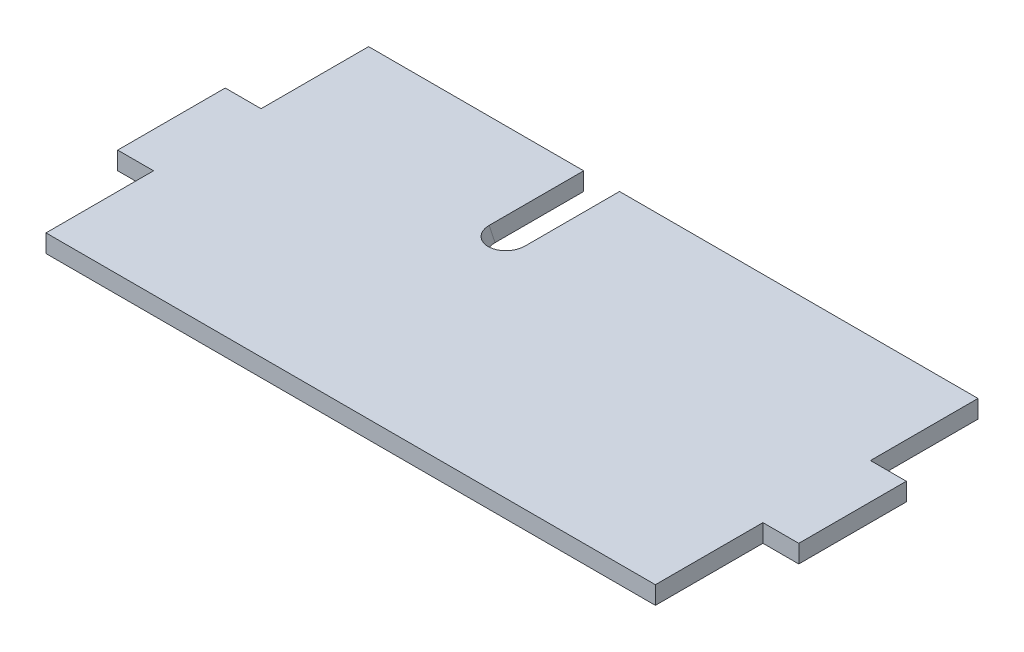
ISO-10303-21;
HEADER;
FILE_DESCRIPTION(('STEP AP214'),'2;1');
FILE_NAME('part.step','',(''),(''),'','','');
FILE_SCHEMA(('AUTOMOTIVE_DESIGN { 1 0 10303 214 1 1 1 1 }'));
ENDSEC;
DATA;
#1=APPLICATION_CONTEXT('core data for automotive mechanical design processes');
#2=APPLICATION_PROTOCOL_DEFINITION('international standard','automotive_design',2000,#1);
#3=PRODUCT_CONTEXT('',#1,'mechanical');
#4=PRODUCT('Part','Part','',(#3));
#5=PRODUCT_RELATED_PRODUCT_CATEGORY('part','',(#4));
#6=PRODUCT_DEFINITION_FORMATION('','',#4);
#7=PRODUCT_DEFINITION_CONTEXT('part definition',#1,'design');
#8=PRODUCT_DEFINITION('design','',#6,#7);
#9=PRODUCT_DEFINITION_SHAPE('','',#8);
#10=(LENGTH_UNIT() NAMED_UNIT(*) SI_UNIT(.MILLI.,.METRE.));
#11=(NAMED_UNIT(*) PLANE_ANGLE_UNIT() SI_UNIT($,.RADIAN.));
#12=(NAMED_UNIT(*) SI_UNIT($,.STERADIAN.) SOLID_ANGLE_UNIT());
#13=UNCERTAINTY_MEASURE_WITH_UNIT(LENGTH_MEASURE(1.E-05),#10,'distance_accuracy_value','');
#14=(GEOMETRIC_REPRESENTATION_CONTEXT(3) GLOBAL_UNCERTAINTY_ASSIGNED_CONTEXT((#13)) GLOBAL_UNIT_ASSIGNED_CONTEXT((#10,
#11,#12)) REPRESENTATION_CONTEXT('',''));
#15=CARTESIAN_POINT('',(0.,0.,0.));
#16=DIRECTION('',(0.,0.,1.));
#17=DIRECTION('',(1.,0.,0.));
#18=AXIS2_PLACEMENT_3D('',#15,#16,#17);
#19=CARTESIAN_POINT('',(-215.9,6.35,-88.9));
#20=DIRECTION('',(0.,0.,1.));
#21=DIRECTION('',(1.,0.,0.));
#22=AXIS2_PLACEMENT_3D('',#19,#20,#21);
#23=PLANE('',#22);
#24=DIRECTION('',(-1.,0.,0.));
#25=VECTOR('',#24,1.);
#26=CARTESIAN_POINT('',(-215.9,6.35,-88.9));
#27=LINE('',#26,#25);
#28=CARTESIAN_POINT('',(-63.5000000000009,6.34999999999999,-88.9));
#29=VERTEX_POINT('',#28);
#30=CARTESIAN_POINT('',(-215.9,6.35,-88.9));
#31=VERTEX_POINT('',#30);
#32=EDGE_CURVE('E279',#29,#31,#27,.T.);
#33=ORIENTED_EDGE('',*,*,#32,.F.);
#34=DIRECTION('',(0.,1.,0.));
#35=VECTOR('',#34,1.);
#36=CARTESIAN_POINT('',(-63.5000000000009,6.34999999999999,-88.9));
#37=LINE('',#36,#35);
#38=CARTESIAN_POINT('',(-63.5000000000009,-6.34999999999999,-88.9));
#39=VERTEX_POINT('',#38);
#40=EDGE_CURVE('E166',#39,#29,#37,.T.);
#41=ORIENTED_EDGE('',*,*,#40,.F.);
#42=DIRECTION('',(-1.,0.,0.));
#43=VECTOR('',#42,1.);
#44=CARTESIAN_POINT('',(-215.9,-6.35,-88.9));
#45=LINE('',#44,#43);
#46=CARTESIAN_POINT('',(-215.9,-6.35,-88.9));
#47=VERTEX_POINT('',#46);
#48=EDGE_CURVE('E173',#39,#47,#45,.T.);
#49=ORIENTED_EDGE('',*,*,#48,.T.);
#50=DIRECTION('',(0.,-1.,0.));
#51=VECTOR('',#50,1.);
#52=CARTESIAN_POINT('',(-215.9,6.35,-88.9));
#53=LINE('',#52,#51);
#54=EDGE_CURVE('E246',#31,#47,#53,.T.);
#55=ORIENTED_EDGE('',*,*,#54,.F.);
#56=EDGE_LOOP('',(#33,#41,#49,#55));
#57=FACE_BOUND('',#56,.T.);
#58=ADVANCED_FACE('F43',(#57),#23,.F.);
#59=CARTESIAN_POINT('',(-50.7999999999984,-226.171808135511,-98.2610939856412));
#60=DIRECTION('',(0.,0.950122861158082,0.31187585463575));
#61=DIRECTION('',(0.,0.31187585463575,-0.950122861158083));
#62=AXIS2_PLACEMENT_3D('',#59,#60,#61);
#63=CYLINDRICAL_SURFACE('',#62,12.7000000000001);
#64=CARTESIAN_POINT('',(-50.7999999999983,-6.34999999999999,-26.1050422974673));
#65=DIRECTION('',(0.,1.,0.));
#66=DIRECTION('',(0.,0.,1.));
#67=AXIS2_PLACEMENT_3D('',#64,#65,#66);
#68=ELLIPSE('',#67,13.3666923712586,12.7000000000001);
#69=CARTESIAN_POINT('',(-38.0999999999989,-6.34999999999999,-26.1050422974674));
#70=VERTEX_POINT('',#69);
#71=CARTESIAN_POINT('',(-63.4999999999984,-6.34999999999999,-26.1050422974673));
#72=VERTEX_POINT('',#71);
#73=EDGE_CURVE('E11',#70,#72,#68,.F.);
#74=ORIENTED_EDGE('',*,*,#73,.T.);
#75=DIRECTION('',(0.,0.950122861158082,0.31187585463575));
#76=VECTOR('',#75,1.);
#77=CARTESIAN_POINT('',(-63.4999999999997,-226.171808135511,-98.2610939856412));
#78=LINE('',#77,#76);
#79=CARTESIAN_POINT('',(-63.4999999999996,6.34999999999999,-21.936293690528));
#80=VERTEX_POINT('',#79);
#81=EDGE_CURVE('E156',#80,#72,#78,.F.);
#82=ORIENTED_EDGE('',*,*,#81,.F.);
#83=CARTESIAN_POINT('',(-50.7999999999983,6.34999999999999,-21.936293690528));
#84=DIRECTION('',(0.,1.,0.));
#85=DIRECTION('',(0.,0.,1.));
#86=AXIS2_PLACEMENT_3D('',#83,#84,#85);
#87=ELLIPSE('',#86,13.3666923712586,12.7000000000001);
#88=CARTESIAN_POINT('',(-38.0999999999982,6.34999999999999,-21.936293690528));
#89=VERTEX_POINT('',#88);
#90=EDGE_CURVE('E47',#89,#80,#87,.F.);
#91=ORIENTED_EDGE('',*,*,#90,.F.);
#92=DIRECTION('',(0.,0.950122861158082,0.31187585463575));
#93=VECTOR('',#92,1.);
#94=CARTESIAN_POINT('',(-38.0999999999989,-226.171808135511,-98.2610939856412));
#95=LINE('',#94,#93);
#96=EDGE_CURVE('E175',#89,#70,#95,.F.);
#97=ORIENTED_EDGE('',*,*,#96,.T.);
#98=EDGE_LOOP('',(#74,#82,#91,#97));
#99=FACE_BOUND('',#98,.T.);
#100=ADVANCED_FACE('F177',(#99),#63,.F.);
#101=CARTESIAN_POINT('',(-215.9,6.35,-88.9));
#102=DIRECTION('',(1.,0.,0.));
#103=DIRECTION('',(0.,0.,-1.));
#104=AXIS2_PLACEMENT_3D('',#101,#102,#103);
#105=PLANE('',#104);
#106=DIRECTION('',(0.,0.,1.));
#107=VECTOR('',#106,1.);
#108=CARTESIAN_POINT('',(-215.9,-6.35,-88.9));
#109=LINE('',#108,#107);
#110=CARTESIAN_POINT('',(-215.9,-6.35,-12.7));
#111=VERTEX_POINT('',#110);
#112=EDGE_CURVE('E165',#47,#111,#109,.T.);
#113=ORIENTED_EDGE('',*,*,#112,.T.);
#114=DIRECTION('',(0.,-1.,0.));
#115=VECTOR('',#114,1.);
#116=CARTESIAN_POINT('',(-215.9,6.35,-12.7));
#117=LINE('',#116,#115);
#118=CARTESIAN_POINT('',(-215.9,6.35,-12.7));
#119=VERTEX_POINT('',#118);
#120=EDGE_CURVE('E191',#119,#111,#117,.T.);
#121=ORIENTED_EDGE('',*,*,#120,.F.);
#122=DIRECTION('',(0.,0.,1.));
#123=VECTOR('',#122,1.);
#124=CARTESIAN_POINT('',(-215.9,6.35,-88.9));
#125=LINE('',#124,#123);
#126=EDGE_CURVE('E309',#31,#119,#125,.T.);
#127=ORIENTED_EDGE('',*,*,#126,.F.);
#128=ORIENTED_EDGE('',*,*,#54,.T.);
#129=EDGE_LOOP('',(#113,#121,#127,#128));
#130=FACE_BOUND('',#129,.T.);
#131=ADVANCED_FACE('F330',(#130),#105,.F.);
#132=CARTESIAN_POINT('',(-241.3,6.35,-12.7));
#133=DIRECTION('',(0.,0.,1.));
#134=DIRECTION('',(1.,0.,0.));
#135=AXIS2_PLACEMENT_3D('',#132,#133,#134);
#136=PLANE('',#135);
#137=DIRECTION('',(-1.,0.,0.));
#138=VECTOR('',#137,1.);
#139=CARTESIAN_POINT('',(-241.3,-6.35,-12.7));
#140=LINE('',#139,#138);
#141=CARTESIAN_POINT('',(-241.3,-6.35,-12.7));
#142=VERTEX_POINT('',#141);
#143=EDGE_CURVE('E196',#111,#142,#140,.T.);
#144=ORIENTED_EDGE('',*,*,#143,.T.);
#145=DIRECTION('',(0.,-1.,0.));
#146=VECTOR('',#145,1.);
#147=CARTESIAN_POINT('',(-241.3,6.35,-12.7));
#148=LINE('',#147,#146);
#149=CARTESIAN_POINT('',(-241.3,6.35,-12.7));
#150=VERTEX_POINT('',#149);
#151=EDGE_CURVE('E197',#150,#142,#148,.T.);
#152=ORIENTED_EDGE('',*,*,#151,.F.);
#153=DIRECTION('',(-1.,0.,0.));
#154=VECTOR('',#153,1.);
#155=CARTESIAN_POINT('',(-241.3,6.35,-12.7));
#156=LINE('',#155,#154);
#157=EDGE_CURVE('E307',#119,#150,#156,.T.);
#158=ORIENTED_EDGE('',*,*,#157,.F.);
#159=ORIENTED_EDGE('',*,*,#120,.T.);
#160=EDGE_LOOP('',(#144,#152,#158,#159));
#161=FACE_BOUND('',#160,.T.);
#162=ADVANCED_FACE('F332',(#161),#136,.F.);
#163=CARTESIAN_POINT('',(-241.3,6.35,-12.7));
#164=DIRECTION('',(1.,0.,0.));
#165=DIRECTION('',(0.,0.,-1.));
#166=AXIS2_PLACEMENT_3D('',#163,#164,#165);
#167=PLANE('',#166);
#168=DIRECTION('',(0.,0.,1.));
#169=VECTOR('',#168,1.);
#170=CARTESIAN_POINT('',(-241.3,-6.35,-12.7));
#171=LINE('',#170,#169);
#172=CARTESIAN_POINT('',(-241.3,-6.35,63.5));
#173=VERTEX_POINT('',#172);
#174=EDGE_CURVE('E195',#142,#173,#171,.T.);
#175=ORIENTED_EDGE('',*,*,#174,.T.);
#176=DIRECTION('',(0.,-1.,0.));
#177=VECTOR('',#176,1.);
#178=CARTESIAN_POINT('',(-241.3,6.35,63.5));
#179=LINE('',#178,#177);
#180=CARTESIAN_POINT('',(-241.3,6.35,63.5));
#181=VERTEX_POINT('',#180);
#182=EDGE_CURVE('E202',#181,#173,#179,.T.);
#183=ORIENTED_EDGE('',*,*,#182,.F.);
#184=DIRECTION('',(0.,0.,1.));
#185=VECTOR('',#184,1.);
#186=CARTESIAN_POINT('',(-241.3,6.35,-12.7));
#187=LINE('',#186,#185);
#188=EDGE_CURVE('E304',#150,#181,#187,.T.);
#189=ORIENTED_EDGE('',*,*,#188,.F.);
#190=ORIENTED_EDGE('',*,*,#151,.T.);
#191=EDGE_LOOP('',(#175,#183,#189,#190));
#192=FACE_BOUND('',#191,.T.);
#193=ADVANCED_FACE('F339',(#192),#167,.F.);
#194=CARTESIAN_POINT('',(-215.9,6.35,63.5));
#195=DIRECTION('',(0.,0.,-1.));
#196=DIRECTION('',(-1.,0.,0.));
#197=AXIS2_PLACEMENT_3D('',#194,#195,#196);
#198=PLANE('',#197);
#199=DIRECTION('',(1.,0.,0.));
#200=VECTOR('',#199,1.);
#201=CARTESIAN_POINT('',(-215.9,-6.35,63.5));
#202=LINE('',#201,#200);
#203=CARTESIAN_POINT('',(-215.9,-6.35,63.5));
#204=VERTEX_POINT('',#203);
#205=EDGE_CURVE('E201',#173,#204,#202,.T.);
#206=ORIENTED_EDGE('',*,*,#205,.T.);
#207=DIRECTION('',(0.,-1.,0.));
#208=VECTOR('',#207,1.);
#209=CARTESIAN_POINT('',(-215.9,6.35,63.5));
#210=LINE('',#209,#208);
#211=CARTESIAN_POINT('',(-215.9,6.35,63.5));
#212=VERTEX_POINT('',#211);
#213=EDGE_CURVE('E207',#212,#204,#210,.T.);
#214=ORIENTED_EDGE('',*,*,#213,.F.);
#215=DIRECTION('',(1.,0.,0.));
#216=VECTOR('',#215,1.);
#217=CARTESIAN_POINT('',(-215.9,6.35,63.5));
#218=LINE('',#217,#216);
#219=EDGE_CURVE('E301',#181,#212,#218,.T.);
#220=ORIENTED_EDGE('',*,*,#219,.F.);
#221=ORIENTED_EDGE('',*,*,#182,.T.);
#222=EDGE_LOOP('',(#206,#214,#220,#221));
#223=FACE_BOUND('',#222,.T.);
#224=ADVANCED_FACE('F343',(#223),#198,.F.);
#225=CARTESIAN_POINT('',(-215.9,6.35,63.5));
#226=DIRECTION('',(1.,0.,0.));
#227=DIRECTION('',(0.,0.,-1.));
#228=AXIS2_PLACEMENT_3D('',#225,#226,#227);
#229=PLANE('',#228);
#230=DIRECTION('',(0.,0.,1.));
#231=VECTOR('',#230,1.);
#232=CARTESIAN_POINT('',(-215.9,-6.35,63.5));
#233=LINE('',#232,#231);
#234=CARTESIAN_POINT('',(-215.9,-6.35,139.7));
#235=VERTEX_POINT('',#234);
#236=EDGE_CURVE('E206',#204,#235,#233,.T.);
#237=ORIENTED_EDGE('',*,*,#236,.T.);
#238=DIRECTION('',(0.,-1.,0.));
#239=VECTOR('',#238,1.);
#240=CARTESIAN_POINT('',(-215.9,6.35,139.7));
#241=LINE('',#240,#239);
#242=CARTESIAN_POINT('',(-215.9,6.35,139.7));
#243=VERTEX_POINT('',#242);
#244=EDGE_CURVE('E212',#243,#235,#241,.T.);
#245=ORIENTED_EDGE('',*,*,#244,.F.);
#246=DIRECTION('',(0.,0.,1.));
#247=VECTOR('',#246,1.);
#248=CARTESIAN_POINT('',(-215.9,6.35,63.5));
#249=LINE('',#248,#247);
#250=EDGE_CURVE('E298',#212,#243,#249,.T.);
#251=ORIENTED_EDGE('',*,*,#250,.F.);
#252=ORIENTED_EDGE('',*,*,#213,.T.);
#253=EDGE_LOOP('',(#237,#245,#251,#252));
#254=FACE_BOUND('',#253,.T.);
#255=ADVANCED_FACE('F348',(#254),#229,.F.);
#256=CARTESIAN_POINT('',(-215.9,6.35,139.7));
#257=DIRECTION('',(0.,0.,-1.));
#258=DIRECTION('',(-1.,0.,0.));
#259=AXIS2_PLACEMENT_3D('',#256,#257,#258);
#260=PLANE('',#259);
#261=DIRECTION('',(1.,0.,0.));
#262=VECTOR('',#261,1.);
#263=CARTESIAN_POINT('',(-215.9,-6.35,139.7));
#264=LINE('',#263,#262);
#265=CARTESIAN_POINT('',(215.9,-6.35,139.7));
#266=VERTEX_POINT('',#265);
#267=EDGE_CURVE('E211',#235,#266,#264,.T.);
#268=ORIENTED_EDGE('',*,*,#267,.T.);
#269=DIRECTION('',(0.,-1.,0.));
#270=VECTOR('',#269,1.);
#271=CARTESIAN_POINT('',(215.9,6.35,139.7));
#272=LINE('',#271,#270);
#273=CARTESIAN_POINT('',(215.9,6.35,139.7));
#274=VERTEX_POINT('',#273);
#275=EDGE_CURVE('E217',#274,#266,#272,.T.);
#276=ORIENTED_EDGE('',*,*,#275,.F.);
#277=DIRECTION('',(1.,0.,0.));
#278=VECTOR('',#277,1.);
#279=CARTESIAN_POINT('',(-215.9,6.35,139.7));
#280=LINE('',#279,#278);
#281=EDGE_CURVE('E295',#243,#274,#280,.T.);
#282=ORIENTED_EDGE('',*,*,#281,.F.);
#283=ORIENTED_EDGE('',*,*,#244,.T.);
#284=EDGE_LOOP('',(#268,#276,#282,#283));
#285=FACE_BOUND('',#284,.T.);
#286=ADVANCED_FACE('F354',(#285),#260,.F.);
#287=CARTESIAN_POINT('',(215.9,6.35,63.5));
#288=DIRECTION('',(-1.,0.,0.));
#289=DIRECTION('',(0.,0.,1.));
#290=AXIS2_PLACEMENT_3D('',#287,#288,#289);
#291=PLANE('',#290);
#292=DIRECTION('',(0.,0.,-1.));
#293=VECTOR('',#292,1.);
#294=CARTESIAN_POINT('',(215.9,-6.35,63.5));
#295=LINE('',#294,#293);
#296=CARTESIAN_POINT('',(215.9,-6.35,63.5));
#297=VERTEX_POINT('',#296);
#298=EDGE_CURVE('E216',#266,#297,#295,.T.);
#299=ORIENTED_EDGE('',*,*,#298,.T.);
#300=DIRECTION('',(0.,-1.,0.));
#301=VECTOR('',#300,1.);
#302=CARTESIAN_POINT('',(215.9,6.35,63.5));
#303=LINE('',#302,#301);
#304=CARTESIAN_POINT('',(215.9,6.35,63.5));
#305=VERTEX_POINT('',#304);
#306=EDGE_CURVE('E222',#305,#297,#303,.T.);
#307=ORIENTED_EDGE('',*,*,#306,.F.);
#308=DIRECTION('',(0.,0.,-1.));
#309=VECTOR('',#308,1.);
#310=CARTESIAN_POINT('',(215.9,6.35,63.5));
#311=LINE('',#310,#309);
#312=EDGE_CURVE('E292',#274,#305,#311,.T.);
#313=ORIENTED_EDGE('',*,*,#312,.F.);
#314=ORIENTED_EDGE('',*,*,#275,.T.);
#315=EDGE_LOOP('',(#299,#307,#313,#314));
#316=FACE_BOUND('',#315,.T.);
#317=ADVANCED_FACE('F358',(#316),#291,.F.);
#318=CARTESIAN_POINT('',(215.9,6.35,63.5));
#319=DIRECTION('',(0.,0.,-1.));
#320=DIRECTION('',(-1.,0.,0.));
#321=AXIS2_PLACEMENT_3D('',#318,#319,#320);
#322=PLANE('',#321);
#323=DIRECTION('',(1.,0.,0.));
#324=VECTOR('',#323,1.);
#325=CARTESIAN_POINT('',(215.9,-6.35,63.5));
#326=LINE('',#325,#324);
#327=CARTESIAN_POINT('',(241.3,-6.35,63.5));
#328=VERTEX_POINT('',#327);
#329=EDGE_CURVE('E221',#297,#328,#326,.T.);
#330=ORIENTED_EDGE('',*,*,#329,.T.);
#331=DIRECTION('',(0.,-1.,0.));
#332=VECTOR('',#331,1.);
#333=CARTESIAN_POINT('',(241.3,6.35,63.5));
#334=LINE('',#333,#332);
#335=CARTESIAN_POINT('',(241.3,6.35,63.5));
#336=VERTEX_POINT('',#335);
#337=EDGE_CURVE('E227',#336,#328,#334,.T.);
#338=ORIENTED_EDGE('',*,*,#337,.F.);
#339=DIRECTION('',(1.,0.,0.));
#340=VECTOR('',#339,1.);
#341=CARTESIAN_POINT('',(215.9,6.35,63.5));
#342=LINE('',#341,#340);
#343=EDGE_CURVE('E289',#305,#336,#342,.T.);
#344=ORIENTED_EDGE('',*,*,#343,.F.);
#345=ORIENTED_EDGE('',*,*,#306,.T.);
#346=EDGE_LOOP('',(#330,#338,#344,#345));
#347=FACE_BOUND('',#346,.T.);
#348=ADVANCED_FACE('F363',(#347),#322,.F.);
#349=CARTESIAN_POINT('',(241.3,6.35,-12.7));
#350=DIRECTION('',(-1.,0.,0.));
#351=DIRECTION('',(0.,0.,1.));
#352=AXIS2_PLACEMENT_3D('',#349,#350,#351);
#353=PLANE('',#352);
#354=DIRECTION('',(0.,0.,-1.));
#355=VECTOR('',#354,1.);
#356=CARTESIAN_POINT('',(241.3,-6.35,-12.7));
#357=LINE('',#356,#355);
#358=CARTESIAN_POINT('',(241.3,-6.35,-12.7));
#359=VERTEX_POINT('',#358);
#360=EDGE_CURVE('E226',#328,#359,#357,.T.);
#361=ORIENTED_EDGE('',*,*,#360,.T.);
#362=DIRECTION('',(0.,-1.,0.));
#363=VECTOR('',#362,1.);
#364=CARTESIAN_POINT('',(241.3,6.35,-12.7));
#365=LINE('',#364,#363);
#366=CARTESIAN_POINT('',(241.3,6.35,-12.7));
#367=VERTEX_POINT('',#366);
#368=EDGE_CURVE('E232',#367,#359,#365,.T.);
#369=ORIENTED_EDGE('',*,*,#368,.F.);
#370=DIRECTION('',(0.,0.,-1.));
#371=VECTOR('',#370,1.);
#372=CARTESIAN_POINT('',(241.3,6.35,-12.7));
#373=LINE('',#372,#371);
#374=EDGE_CURVE('E286',#336,#367,#373,.T.);
#375=ORIENTED_EDGE('',*,*,#374,.F.);
#376=ORIENTED_EDGE('',*,*,#337,.T.);
#377=EDGE_LOOP('',(#361,#369,#375,#376));
#378=FACE_BOUND('',#377,.T.);
#379=ADVANCED_FACE('F369',(#378),#353,.F.);
#380=CARTESIAN_POINT('',(241.3,6.35,-12.7));
#381=DIRECTION('',(0.,0.,1.));
#382=DIRECTION('',(1.,0.,0.));
#383=AXIS2_PLACEMENT_3D('',#380,#381,#382);
#384=PLANE('',#383);
#385=DIRECTION('',(-1.,0.,0.));
#386=VECTOR('',#385,1.);
#387=CARTESIAN_POINT('',(241.3,-6.35,-12.7));
#388=LINE('',#387,#386);
#389=CARTESIAN_POINT('',(215.9,-6.35,-12.7));
#390=VERTEX_POINT('',#389);
#391=EDGE_CURVE('E231',#359,#390,#388,.T.);
#392=ORIENTED_EDGE('',*,*,#391,.T.);
#393=DIRECTION('',(0.,-1.,0.));
#394=VECTOR('',#393,1.);
#395=CARTESIAN_POINT('',(215.9,6.35,-12.7));
#396=LINE('',#395,#394);
#397=CARTESIAN_POINT('',(215.9,6.35,-12.7));
#398=VERTEX_POINT('',#397);
#399=EDGE_CURVE('E237',#398,#390,#396,.T.);
#400=ORIENTED_EDGE('',*,*,#399,.F.);
#401=DIRECTION('',(-1.,0.,0.));
#402=VECTOR('',#401,1.);
#403=CARTESIAN_POINT('',(241.3,6.35,-12.7));
#404=LINE('',#403,#402);
#405=EDGE_CURVE('E283',#367,#398,#404,.T.);
#406=ORIENTED_EDGE('',*,*,#405,.F.);
#407=ORIENTED_EDGE('',*,*,#368,.T.);
#408=EDGE_LOOP('',(#392,#400,#406,#407));
#409=FACE_BOUND('',#408,.T.);
#410=ADVANCED_FACE('F373',(#409),#384,.F.);
#411=CARTESIAN_POINT('',(215.9,6.35,-88.9));
#412=DIRECTION('',(-1.,0.,0.));
#413=DIRECTION('',(0.,0.,1.));
#414=AXIS2_PLACEMENT_3D('',#411,#412,#413);
#415=PLANE('',#414);
#416=DIRECTION('',(0.,0.,-1.));
#417=VECTOR('',#416,1.);
#418=CARTESIAN_POINT('',(215.9,-6.35,-88.9));
#419=LINE('',#418,#417);
#420=CARTESIAN_POINT('',(215.9,-6.35,-88.9));
#421=VERTEX_POINT('',#420);
#422=EDGE_CURVE('E236',#390,#421,#419,.T.);
#423=ORIENTED_EDGE('',*,*,#422,.T.);
#424=DIRECTION('',(0.,-1.,0.));
#425=VECTOR('',#424,1.);
#426=CARTESIAN_POINT('',(215.9,6.35,-88.9));
#427=LINE('',#426,#425);
#428=CARTESIAN_POINT('',(215.9,6.35,-88.9));
#429=VERTEX_POINT('',#428);
#430=EDGE_CURVE('E241',#429,#421,#427,.T.);
#431=ORIENTED_EDGE('',*,*,#430,.F.);
#432=DIRECTION('',(0.,0.,-1.));
#433=VECTOR('',#432,1.);
#434=CARTESIAN_POINT('',(215.9,6.35,-88.9));
#435=LINE('',#434,#433);
#436=EDGE_CURVE('E280',#398,#429,#435,.T.);
#437=ORIENTED_EDGE('',*,*,#436,.F.);
#438=ORIENTED_EDGE('',*,*,#399,.T.);
#439=EDGE_LOOP('',(#423,#431,#437,#438));
#440=FACE_BOUND('',#439,.T.);
#441=ADVANCED_FACE('F378',(#440),#415,.F.);
#442=CARTESIAN_POINT('',(-38.1000000000006,-6.35,-88.9));
#443=VERTEX_POINT('',#442);
#444=EDGE_CURVE('E245',#421,#443,#45,.T.);
#445=ORIENTED_EDGE('',*,*,#444,.T.);
#446=DIRECTION('',(0.,-1.,0.));
#447=VECTOR('',#446,1.);
#448=CARTESIAN_POINT('',(-38.1000000000006,-6.35,-88.9));
#449=LINE('',#448,#447);
#450=CARTESIAN_POINT('',(-38.1000000000007,6.34999999999999,-88.9));
#451=VERTEX_POINT('',#450);
#452=EDGE_CURVE('E182',#451,#443,#449,.T.);
#453=ORIENTED_EDGE('',*,*,#452,.F.);
#454=EDGE_CURVE('E53',#429,#451,#27,.T.);
#455=ORIENTED_EDGE('',*,*,#454,.F.);
#456=ORIENTED_EDGE('',*,*,#430,.T.);
#457=EDGE_LOOP('',(#445,#453,#455,#456));
#458=FACE_BOUND('',#457,.T.);
#459=ADVANCED_FACE('F321',(#458),#23,.F.);
#460=CARTESIAN_POINT('',(0.,6.35,0.));
#461=DIRECTION('',(0.,1.,0.));
#462=DIRECTION('',(0.,0.,1.));
#463=AXIS2_PLACEMENT_3D('',#460,#461,#462);
#464=PLANE('',#463);
#465=DIRECTION('',(0.,0.,-1.));
#466=VECTOR('',#465,1.);
#467=CARTESIAN_POINT('',(-63.5000000000009,6.34999999999999,139.701));
#468=LINE('',#467,#466);
#469=EDGE_CURVE('E69',#80,#29,#468,.T.);
#470=ORIENTED_EDGE('',*,*,#469,.T.);
#471=ORIENTED_EDGE('',*,*,#32,.T.);
#472=ORIENTED_EDGE('',*,*,#126,.T.);
#473=ORIENTED_EDGE('',*,*,#157,.T.);
#474=ORIENTED_EDGE('',*,*,#188,.T.);
#475=ORIENTED_EDGE('',*,*,#219,.T.);
#476=ORIENTED_EDGE('',*,*,#250,.T.);
#477=ORIENTED_EDGE('',*,*,#281,.T.);
#478=ORIENTED_EDGE('',*,*,#312,.T.);
#479=ORIENTED_EDGE('',*,*,#343,.T.);
#480=ORIENTED_EDGE('',*,*,#374,.T.);
#481=ORIENTED_EDGE('',*,*,#405,.T.);
#482=ORIENTED_EDGE('',*,*,#436,.T.);
#483=ORIENTED_EDGE('',*,*,#454,.T.);
#484=DIRECTION('',(0.,0.,-1.));
#485=VECTOR('',#484,1.);
#486=CARTESIAN_POINT('',(-38.1000000000007,6.34999999999999,139.701));
#487=LINE('',#486,#485);
#488=EDGE_CURVE('E186',#89,#451,#487,.T.);
#489=ORIENTED_EDGE('',*,*,#488,.F.);
#490=ORIENTED_EDGE('',*,*,#90,.T.);
#491=EDGE_LOOP('',(#470,#471,#472,#473,#474,#475,#476,#477,#478,#479,#480,#481,#482,#483,#489,#490));
#492=FACE_BOUND('',#491,.T.);
#493=ADVANCED_FACE('F45',(#492),#464,.T.);
#494=CARTESIAN_POINT('',(0.,-6.35,0.));
#495=DIRECTION('',(0.,1.,0.));
#496=DIRECTION('',(0.,0.,1.));
#497=AXIS2_PLACEMENT_3D('',#494,#495,#496);
#498=PLANE('',#497);
#499=ORIENTED_EDGE('',*,*,#48,.F.);
#500=DIRECTION('',(0.,0.,-1.));
#501=VECTOR('',#500,1.);
#502=CARTESIAN_POINT('',(-63.5000000000009,-6.34999999999999,139.701));
#503=LINE('',#502,#501);
#504=EDGE_CURVE('E159',#72,#39,#503,.T.);
#505=ORIENTED_EDGE('',*,*,#504,.F.);
#506=ORIENTED_EDGE('',*,*,#73,.F.);
#507=DIRECTION('',(0.,0.,-1.));
#508=VECTOR('',#507,1.);
#509=CARTESIAN_POINT('',(-38.1000000000006,-6.35,139.701));
#510=LINE('',#509,#508);
#511=EDGE_CURVE('E61',#70,#443,#510,.T.);
#512=ORIENTED_EDGE('',*,*,#511,.T.);
#513=ORIENTED_EDGE('',*,*,#444,.F.);
#514=ORIENTED_EDGE('',*,*,#422,.F.);
#515=ORIENTED_EDGE('',*,*,#391,.F.);
#516=ORIENTED_EDGE('',*,*,#360,.F.);
#517=ORIENTED_EDGE('',*,*,#329,.F.);
#518=ORIENTED_EDGE('',*,*,#298,.F.);
#519=ORIENTED_EDGE('',*,*,#267,.F.);
#520=ORIENTED_EDGE('',*,*,#236,.F.);
#521=ORIENTED_EDGE('',*,*,#205,.F.);
#522=ORIENTED_EDGE('',*,*,#174,.F.);
#523=ORIENTED_EDGE('',*,*,#143,.F.);
#524=ORIENTED_EDGE('',*,*,#112,.F.);
#525=EDGE_LOOP('',(#499,#505,#506,#512,#513,#514,#515,#516,#517,#518,#519,#520,#521,#522,#523,#524));
#526=FACE_BOUND('',#525,.T.);
#527=ADVANCED_FACE('F171',(#526),#498,.F.);
#528=CARTESIAN_POINT('',(-38.1000000000006,-6.35,139.701));
#529=DIRECTION('',(1.,0.,0.));
#530=DIRECTION('',(0.,1.,0.));
#531=AXIS2_PLACEMENT_3D('',#528,#529,#530);
#532=PLANE('',#531);
#533=ORIENTED_EDGE('',*,*,#488,.T.);
#534=ORIENTED_EDGE('',*,*,#452,.T.);
#535=ORIENTED_EDGE('',*,*,#511,.F.);
#536=ORIENTED_EDGE('',*,*,#96,.F.);
#537=EDGE_LOOP('',(#533,#534,#535,#536));
#538=FACE_BOUND('',#537,.T.);
#539=ADVANCED_FACE('F319',(#538),#532,.F.);
#540=CARTESIAN_POINT('',(-63.5000000000009,6.34999999999999,139.701));
#541=DIRECTION('',(-1.,0.,0.));
#542=DIRECTION('',(0.,0.,1.));
#543=AXIS2_PLACEMENT_3D('',#540,#541,#542);
#544=PLANE('',#543);
#545=ORIENTED_EDGE('',*,*,#81,.T.);
#546=ORIENTED_EDGE('',*,*,#504,.T.);
#547=ORIENTED_EDGE('',*,*,#40,.T.);
#548=ORIENTED_EDGE('',*,*,#469,.F.);
#549=EDGE_LOOP('',(#545,#546,#547,#548));
#550=FACE_BOUND('',#549,.T.);
#551=ADVANCED_FACE('F158',(#550),#544,.F.);
#552=CLOSED_SHELL('',(#58,#100,#131,#162,#193,#224,#255,#286,#317,#348,#379,#410,#441,#459,#493,
#527,#539,#551));
#553=MANIFOLD_SOLID_BREP('B2',#552);
#554=ADVANCED_BREP_SHAPE_REPRESENTATION('',(#18,#553),#14);
#555=SHAPE_DEFINITION_REPRESENTATION(#9,#554);
ENDSEC;
END-ISO-10303-21;
